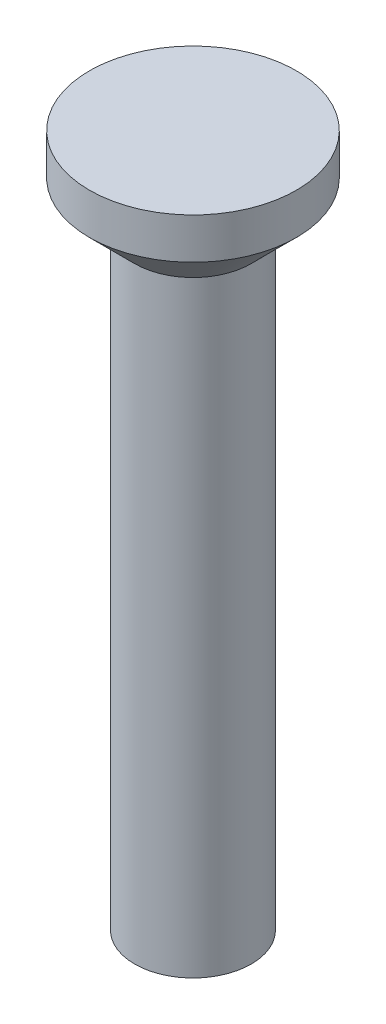
ISO-10303-21;
HEADER;
FILE_DESCRIPTION(('STEP AP214'),'2;1');
FILE_NAME('part.step','',(''),(''),'','','');
FILE_SCHEMA(('AUTOMOTIVE_DESIGN { 1 0 10303 214 1 1 1 1 }'));
ENDSEC;
DATA;
#1=APPLICATION_CONTEXT('core data for automotive mechanical design processes');
#2=APPLICATION_PROTOCOL_DEFINITION('international standard','automotive_design',2000,#1);
#3=PRODUCT_CONTEXT('',#1,'mechanical');
#4=PRODUCT('Part','Part','',(#3));
#5=PRODUCT_RELATED_PRODUCT_CATEGORY('part','',(#4));
#6=PRODUCT_DEFINITION_FORMATION('','',#4);
#7=PRODUCT_DEFINITION_CONTEXT('part definition',#1,'design');
#8=PRODUCT_DEFINITION('design','',#6,#7);
#9=PRODUCT_DEFINITION_SHAPE('','',#8);
#10=(LENGTH_UNIT() NAMED_UNIT(*) SI_UNIT(.MILLI.,.METRE.));
#11=(NAMED_UNIT(*) PLANE_ANGLE_UNIT() SI_UNIT($,.RADIAN.));
#12=(NAMED_UNIT(*) SI_UNIT($,.STERADIAN.) SOLID_ANGLE_UNIT());
#13=UNCERTAINTY_MEASURE_WITH_UNIT(LENGTH_MEASURE(1.E-05),#10,'distance_accuracy_value','');
#14=(GEOMETRIC_REPRESENTATION_CONTEXT(3) GLOBAL_UNCERTAINTY_ASSIGNED_CONTEXT((#13)) GLOBAL_UNIT_ASSIGNED_CONTEXT((#10,
#11,#12)) REPRESENTATION_CONTEXT('',''));
#15=CARTESIAN_POINT('',(0.,0.,0.));
#16=DIRECTION('',(0.,0.,1.));
#17=DIRECTION('',(1.,0.,0.));
#18=AXIS2_PLACEMENT_3D('',#15,#16,#17);
#19=CARTESIAN_POINT('',(0.,0.,0.));
#20=DIRECTION('',(0.,1.,0.));
#21=DIRECTION('',(0.,0.,1.));
#22=AXIS2_PLACEMENT_3D('',#19,#20,#21);
#23=PLANE('',#22);
#24=CARTESIAN_POINT('',(0.,0.,0.));
#25=DIRECTION('',(0.,1.,0.));
#26=DIRECTION('',(0.,0.,1.));
#27=AXIS2_PLACEMENT_3D('',#24,#25,#26);
#28=CIRCLE('',#27,25.);
#29=CARTESIAN_POINT('',(0.,0.,25.));
#30=VERTEX_POINT('',#29);
#31=EDGE_CURVE('E10',#30,#30,#28,.T.);
#32=ORIENTED_EDGE('',*,*,#31,.F.);
#33=EDGE_LOOP('',(#32));
#34=FACE_BOUND('',#33,.T.);
#35=ADVANCED_FACE('F32',(#34),#23,.F.);
#36=CARTESIAN_POINT('',(0.,348.080420571429,0.));
#37=DIRECTION('',(0.,1.,0.));
#38=DIRECTION('',(0.,0.,1.));
#39=AXIS2_PLACEMENT_3D('',#36,#37,#38);
#40=CYLINDRICAL_SURFACE('',#39,25.);
#41=CARTESIAN_POINT('',(0.,260.,0.));
#42=DIRECTION('',(0.,1.,0.));
#43=DIRECTION('',(0.,0.,1.));
#44=AXIS2_PLACEMENT_3D('',#41,#42,#43);
#45=CIRCLE('',#44,25.);
#46=CARTESIAN_POINT('',(0.,260.,25.));
#47=VERTEX_POINT('',#46);
#48=EDGE_CURVE('E38',#47,#47,#45,.T.);
#49=ORIENTED_EDGE('',*,*,#48,.F.);
#50=EDGE_LOOP('',(#49));
#51=FACE_BOUND('',#50,.T.);
#52=ORIENTED_EDGE('',*,*,#31,.T.);
#53=EDGE_LOOP('',(#52));
#54=FACE_BOUND('',#53,.T.);
#55=ADVANCED_FACE('F62',(#51,#54),#40,.T.);
#56=CARTESIAN_POINT('',(0.,260.,0.));
#57=DIRECTION('',(0.,1.,0.));
#58=DIRECTION('',(0.,0.,1.));
#59=AXIS2_PLACEMENT_3D('',#56,#57,#58);
#60=CONICAL_SURFACE('',#59,25.,0.785398163397448);
#61=CARTESIAN_POINT('',(0.,279.353980996461,0.));
#62=DIRECTION('',(0.,1.,0.));
#63=DIRECTION('',(0.,0.,1.));
#64=AXIS2_PLACEMENT_3D('',#61,#62,#63);
#65=CIRCLE('',#64,44.3539809964609);
#66=CARTESIAN_POINT('',(0.,279.353980996461,44.3539809964609));
#67=VERTEX_POINT('',#66);
#68=EDGE_CURVE('E42',#67,#67,#65,.T.);
#69=ORIENTED_EDGE('',*,*,#68,.F.);
#70=EDGE_LOOP('',(#69));
#71=FACE_BOUND('',#70,.T.);
#72=ORIENTED_EDGE('',*,*,#48,.T.);
#73=EDGE_LOOP('',(#72));
#74=FACE_BOUND('',#73,.T.);
#75=ADVANCED_FACE('F57',(#71,#74),#60,.T.);
#76=CARTESIAN_POINT('',(0.,348.080420571429,0.));
#77=DIRECTION('',(0.,1.,0.));
#78=DIRECTION('',(0.,0.,1.));
#79=AXIS2_PLACEMENT_3D('',#76,#77,#78);
#80=CYLINDRICAL_SURFACE('',#79,44.3539809964609);
#81=CARTESIAN_POINT('',(0.,296.92423796309,0.));
#82=DIRECTION('',(0.,1.,0.));
#83=DIRECTION('',(0.,0.,1.));
#84=AXIS2_PLACEMENT_3D('',#81,#82,#83);
#85=CIRCLE('',#84,44.3539809964609);
#86=CARTESIAN_POINT('',(0.,296.92423796309,44.3539809964609));
#87=VERTEX_POINT('',#86);
#88=EDGE_CURVE('E46',#87,#87,#85,.T.);
#89=ORIENTED_EDGE('',*,*,#88,.F.);
#90=EDGE_LOOP('',(#89));
#91=FACE_BOUND('',#90,.T.);
#92=ORIENTED_EDGE('',*,*,#68,.T.);
#93=EDGE_LOOP('',(#92));
#94=FACE_BOUND('',#93,.T.);
#95=ADVANCED_FACE('F54',(#91,#94),#80,.T.);
#96=CARTESIAN_POINT('',(44.3539809964609,296.92423796309,0.));
#97=DIRECTION('',(0.,-1.,0.));
#98=DIRECTION('',(0.,0.,-1.));
#99=AXIS2_PLACEMENT_3D('',#96,#97,#98);
#100=PLANE('',#99);
#101=ORIENTED_EDGE('',*,*,#88,.T.);
#102=EDGE_LOOP('',(#101));
#103=FACE_BOUND('',#102,.T.);
#104=ADVANCED_FACE('F52',(#103),#100,.F.);
#105=CLOSED_SHELL('',(#35,#55,#75,#95,#104));
#106=MANIFOLD_SOLID_BREP('B2',#105);
#107=ADVANCED_BREP_SHAPE_REPRESENTATION('',(#18,#106),#14);
#108=SHAPE_DEFINITION_REPRESENTATION(#9,#107);
ENDSEC;
END-ISO-10303-21;
